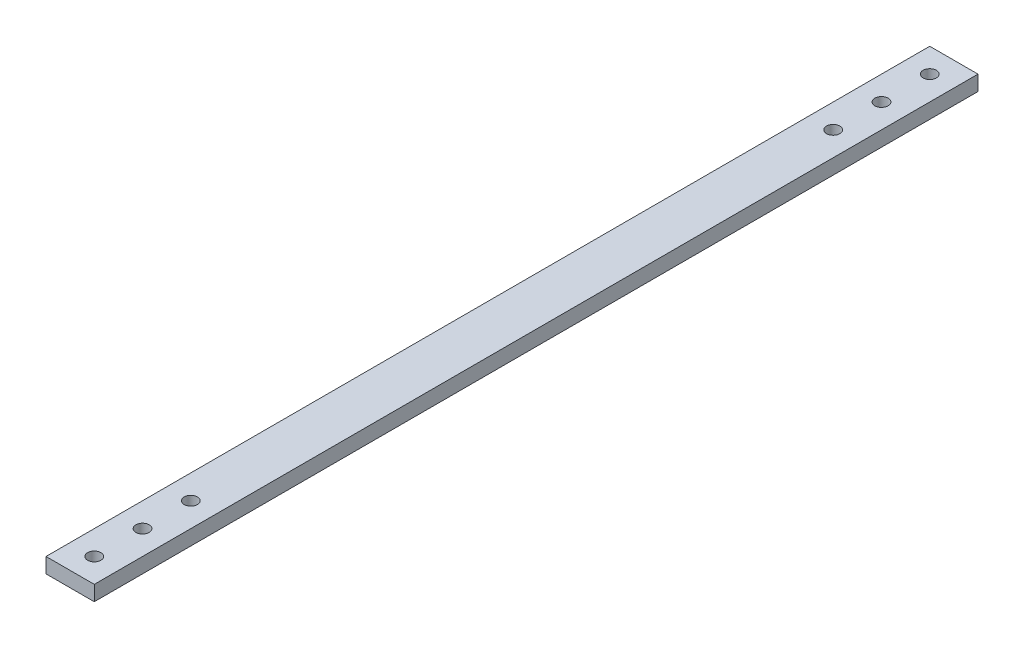
ISO-10303-21;
HEADER;
FILE_DESCRIPTION(('STEP AP214'),'2;1');
FILE_NAME('part.step','',(''),(''),'','','');
FILE_SCHEMA(('AUTOMOTIVE_DESIGN { 1 0 10303 214 1 1 1 1 }'));
ENDSEC;
DATA;
#1=APPLICATION_CONTEXT('core data for automotive mechanical design processes');
#2=APPLICATION_PROTOCOL_DEFINITION('international standard','automotive_design',2000,#1);
#3=PRODUCT_CONTEXT('',#1,'mechanical');
#4=PRODUCT('Part','Part','',(#3));
#5=PRODUCT_RELATED_PRODUCT_CATEGORY('part','',(#4));
#6=PRODUCT_DEFINITION_FORMATION('','',#4);
#7=PRODUCT_DEFINITION_CONTEXT('part definition',#1,'design');
#8=PRODUCT_DEFINITION('design','',#6,#7);
#9=PRODUCT_DEFINITION_SHAPE('','',#8);
#10=(LENGTH_UNIT() NAMED_UNIT(*) SI_UNIT(.MILLI.,.METRE.));
#11=(NAMED_UNIT(*) PLANE_ANGLE_UNIT() SI_UNIT($,.RADIAN.));
#12=(NAMED_UNIT(*) SI_UNIT($,.STERADIAN.) SOLID_ANGLE_UNIT());
#13=UNCERTAINTY_MEASURE_WITH_UNIT(LENGTH_MEASURE(1.E-05),#10,'distance_accuracy_value','');
#14=(GEOMETRIC_REPRESENTATION_CONTEXT(3) GLOBAL_UNCERTAINTY_ASSIGNED_CONTEXT((#13)) GLOBAL_UNIT_ASSIGNED_CONTEXT((#10,
#11,#12)) REPRESENTATION_CONTEXT('',''));
#15=CARTESIAN_POINT('',(0.,0.,0.));
#16=DIRECTION('',(0.,0.,1.));
#17=DIRECTION('',(1.,0.,0.));
#18=AXIS2_PLACEMENT_3D('',#15,#16,#17);
#19=CARTESIAN_POINT('',(-12.7,3.96875,232.5));
#20=DIRECTION('',(1.,0.,0.));
#21=DIRECTION('',(0.,0.,-1.));
#22=AXIS2_PLACEMENT_3D('',#19,#20,#21);
#23=PLANE('',#22);
#24=DIRECTION('',(0.,-1.,0.));
#25=VECTOR('',#24,1.);
#26=CARTESIAN_POINT('',(-12.7,3.96875,-232.5));
#27=LINE('',#26,#25);
#28=CARTESIAN_POINT('',(-12.7,3.96875,-232.5));
#29=VERTEX_POINT('',#28);
#30=CARTESIAN_POINT('',(-12.7,-3.96875,-232.5));
#31=VERTEX_POINT('',#30);
#32=EDGE_CURVE('E100',#29,#31,#27,.T.);
#33=ORIENTED_EDGE('',*,*,#32,.T.);
#34=DIRECTION('',(0.,0.,-1.));
#35=VECTOR('',#34,1.);
#36=CARTESIAN_POINT('',(-12.7,-3.96875,232.5));
#37=LINE('',#36,#35);
#38=CARTESIAN_POINT('',(-12.7,-3.96875,232.5));
#39=VERTEX_POINT('',#38);
#40=EDGE_CURVE('E11',#39,#31,#37,.T.);
#41=ORIENTED_EDGE('',*,*,#40,.F.);
#42=DIRECTION('',(0.,-1.,0.));
#43=VECTOR('',#42,1.);
#44=CARTESIAN_POINT('',(-12.7,3.96875,232.5));
#45=LINE('',#44,#43);
#46=CARTESIAN_POINT('',(-12.7,3.96875,232.5));
#47=VERTEX_POINT('',#46);
#48=EDGE_CURVE('E88',#47,#39,#45,.T.);
#49=ORIENTED_EDGE('',*,*,#48,.F.);
#50=DIRECTION('',(0.,0.,-1.));
#51=VECTOR('',#50,1.);
#52=CARTESIAN_POINT('',(-12.7,3.96875,232.5));
#53=LINE('',#52,#51);
#54=EDGE_CURVE('E96',#47,#29,#53,.T.);
#55=ORIENTED_EDGE('',*,*,#54,.T.);
#56=EDGE_LOOP('',(#33,#41,#49,#55));
#57=FACE_BOUND('',#56,.T.);
#58=ADVANCED_FACE('F37',(#57),#23,.F.);
#59=CARTESIAN_POINT('',(12.7,-3.96875,232.5));
#60=DIRECTION('',(0.,1.,0.));
#61=DIRECTION('',(0.,0.,1.));
#62=AXIS2_PLACEMENT_3D('',#59,#60,#61);
#63=PLANE('',#62);
#64=CARTESIAN_POINT('',(0.,-3.96875,-219.8));
#65=DIRECTION('',(0.,1.,0.));
#66=DIRECTION('',(0.,0.,1.));
#67=AXIS2_PLACEMENT_3D('',#64,#65,#66);
#68=CIRCLE('',#67,3.5);
#69=CARTESIAN_POINT('',(0.,-3.96875,-216.3));
#70=VERTEX_POINT('',#69);
#71=EDGE_CURVE('E103',#70,#70,#68,.T.);
#72=ORIENTED_EDGE('',*,*,#71,.T.);
#73=EDGE_LOOP('',(#72));
#74=FACE_BOUND('',#73,.T.);
#75=CARTESIAN_POINT('',(0.,-3.96875,-194.4));
#76=DIRECTION('',(0.,1.,0.));
#77=DIRECTION('',(0.,0.,1.));
#78=AXIS2_PLACEMENT_3D('',#75,#76,#77);
#79=CIRCLE('',#78,3.5);
#80=CARTESIAN_POINT('',(0.,-3.96875,-190.9));
#81=VERTEX_POINT('',#80);
#82=EDGE_CURVE('E141',#81,#81,#79,.T.);
#83=ORIENTED_EDGE('',*,*,#82,.T.);
#84=EDGE_LOOP('',(#83));
#85=FACE_BOUND('',#84,.T.);
#86=CARTESIAN_POINT('',(0.,-3.96875,-169.));
#87=DIRECTION('',(0.,1.,0.));
#88=DIRECTION('',(0.,0.,1.));
#89=AXIS2_PLACEMENT_3D('',#86,#87,#88);
#90=CIRCLE('',#89,3.5);
#91=CARTESIAN_POINT('',(0.,-3.96875,-165.5));
#92=VERTEX_POINT('',#91);
#93=EDGE_CURVE('E135',#92,#92,#90,.T.);
#94=ORIENTED_EDGE('',*,*,#93,.T.);
#95=EDGE_LOOP('',(#94));
#96=FACE_BOUND('',#95,.T.);
#97=CARTESIAN_POINT('',(0.,-3.96875,169.));
#98=DIRECTION('',(0.,1.,0.));
#99=DIRECTION('',(0.,0.,-1.));
#100=AXIS2_PLACEMENT_3D('',#97,#98,#99);
#101=CIRCLE('',#100,3.5);
#102=CARTESIAN_POINT('',(0.,-3.96875,165.5));
#103=VERTEX_POINT('',#102);
#104=EDGE_CURVE('E129',#103,#103,#101,.T.);
#105=ORIENTED_EDGE('',*,*,#104,.T.);
#106=EDGE_LOOP('',(#105));
#107=FACE_BOUND('',#106,.T.);
#108=CARTESIAN_POINT('',(0.,-3.96875,194.4));
#109=DIRECTION('',(0.,1.,0.));
#110=DIRECTION('',(0.,0.,-1.));
#111=AXIS2_PLACEMENT_3D('',#108,#109,#110);
#112=CIRCLE('',#111,3.5);
#113=CARTESIAN_POINT('',(0.,-3.96875,190.9));
#114=VERTEX_POINT('',#113);
#115=EDGE_CURVE('E123',#114,#114,#112,.T.);
#116=ORIENTED_EDGE('',*,*,#115,.T.);
#117=EDGE_LOOP('',(#116));
#118=FACE_BOUND('',#117,.T.);
#119=CARTESIAN_POINT('',(0.,-3.96875,219.8));
#120=DIRECTION('',(0.,1.,0.));
#121=DIRECTION('',(0.,0.,-1.));
#122=AXIS2_PLACEMENT_3D('',#119,#120,#121);
#123=CIRCLE('',#122,3.5);
#124=CARTESIAN_POINT('',(0.,-3.96875,216.3));
#125=VERTEX_POINT('',#124);
#126=EDGE_CURVE('E117',#125,#125,#123,.T.);
#127=ORIENTED_EDGE('',*,*,#126,.T.);
#128=EDGE_LOOP('',(#127));
#129=FACE_BOUND('',#128,.T.);
#130=DIRECTION('',(1.,0.,0.));
#131=VECTOR('',#130,1.);
#132=CARTESIAN_POINT('',(12.7,-3.96875,-232.5));
#133=LINE('',#132,#131);
#134=CARTESIAN_POINT('',(12.7,-3.96875,-232.5));
#135=VERTEX_POINT('',#134);
#136=EDGE_CURVE('E92',#31,#135,#133,.T.);
#137=ORIENTED_EDGE('',*,*,#136,.T.);
#138=DIRECTION('',(0.,0.,-1.));
#139=VECTOR('',#138,1.);
#140=CARTESIAN_POINT('',(12.7,-3.96875,232.5));
#141=LINE('',#140,#139);
#142=CARTESIAN_POINT('',(12.7,-3.96875,232.5));
#143=VERTEX_POINT('',#142);
#144=EDGE_CURVE('E45',#143,#135,#141,.T.);
#145=ORIENTED_EDGE('',*,*,#144,.F.);
#146=DIRECTION('',(1.,0.,0.));
#147=VECTOR('',#146,1.);
#148=CARTESIAN_POINT('',(12.7,-3.96875,232.5));
#149=LINE('',#148,#147);
#150=EDGE_CURVE('E83',#39,#143,#149,.T.);
#151=ORIENTED_EDGE('',*,*,#150,.F.);
#152=ORIENTED_EDGE('',*,*,#40,.T.);
#153=EDGE_LOOP('',(#137,#145,#151,#152));
#154=FACE_BOUND('',#153,.T.);
#155=ADVANCED_FACE('F91',(#74,#85,#96,#107,#118,#129,#154),#63,.F.);
#156=CARTESIAN_POINT('',(12.7,3.96875,232.5));
#157=DIRECTION('',(-1.,0.,0.));
#158=DIRECTION('',(0.,0.,1.));
#159=AXIS2_PLACEMENT_3D('',#156,#157,#158);
#160=PLANE('',#159);
#161=DIRECTION('',(0.,1.,0.));
#162=VECTOR('',#161,1.);
#163=CARTESIAN_POINT('',(12.7,3.96875,-232.5));
#164=LINE('',#163,#162);
#165=CARTESIAN_POINT('',(12.7,3.96875,-232.5));
#166=VERTEX_POINT('',#165);
#167=EDGE_CURVE('E70',#135,#166,#164,.T.);
#168=ORIENTED_EDGE('',*,*,#167,.T.);
#169=DIRECTION('',(0.,0.,-1.));
#170=VECTOR('',#169,1.);
#171=CARTESIAN_POINT('',(12.7,3.96875,232.5));
#172=LINE('',#171,#170);
#173=CARTESIAN_POINT('',(12.7,3.96875,232.5));
#174=VERTEX_POINT('',#173);
#175=EDGE_CURVE('E93',#174,#166,#172,.T.);
#176=ORIENTED_EDGE('',*,*,#175,.F.);
#177=DIRECTION('',(0.,1.,0.));
#178=VECTOR('',#177,1.);
#179=CARTESIAN_POINT('',(12.7,3.96875,232.5));
#180=LINE('',#179,#178);
#181=EDGE_CURVE('E86',#143,#174,#180,.T.);
#182=ORIENTED_EDGE('',*,*,#181,.F.);
#183=ORIENTED_EDGE('',*,*,#144,.T.);
#184=EDGE_LOOP('',(#168,#176,#182,#183));
#185=FACE_BOUND('',#184,.T.);
#186=ADVANCED_FACE('F94',(#185),#160,.F.);
#187=CARTESIAN_POINT('',(12.7,3.96875,232.5));
#188=DIRECTION('',(0.,-1.,0.));
#189=DIRECTION('',(0.,0.,-1.));
#190=AXIS2_PLACEMENT_3D('',#187,#188,#189);
#191=PLANE('',#190);
#192=CARTESIAN_POINT('',(0.,3.96875,-219.8));
#193=DIRECTION('',(0.,1.,0.));
#194=DIRECTION('',(0.,0.,1.));
#195=AXIS2_PLACEMENT_3D('',#192,#193,#194);
#196=CIRCLE('',#195,3.5);
#197=CARTESIAN_POINT('',(0.,3.96875,-216.3));
#198=VERTEX_POINT('',#197);
#199=EDGE_CURVE('E144',#198,#198,#196,.T.);
#200=ORIENTED_EDGE('',*,*,#199,.F.);
#201=EDGE_LOOP('',(#200));
#202=FACE_BOUND('',#201,.T.);
#203=CARTESIAN_POINT('',(0.,3.96875,-194.4));
#204=DIRECTION('',(0.,1.,0.));
#205=DIRECTION('',(0.,0.,1.));
#206=AXIS2_PLACEMENT_3D('',#203,#204,#205);
#207=CIRCLE('',#206,3.5);
#208=CARTESIAN_POINT('',(0.,3.96875,-190.9));
#209=VERTEX_POINT('',#208);
#210=EDGE_CURVE('E138',#209,#209,#207,.T.);
#211=ORIENTED_EDGE('',*,*,#210,.F.);
#212=EDGE_LOOP('',(#211));
#213=FACE_BOUND('',#212,.T.);
#214=CARTESIAN_POINT('',(0.,3.96875,-169.));
#215=DIRECTION('',(0.,1.,0.));
#216=DIRECTION('',(0.,0.,1.));
#217=AXIS2_PLACEMENT_3D('',#214,#215,#216);
#218=CIRCLE('',#217,3.5);
#219=CARTESIAN_POINT('',(0.,3.96875,-165.5));
#220=VERTEX_POINT('',#219);
#221=EDGE_CURVE('E132',#220,#220,#218,.T.);
#222=ORIENTED_EDGE('',*,*,#221,.F.);
#223=EDGE_LOOP('',(#222));
#224=FACE_BOUND('',#223,.T.);
#225=CARTESIAN_POINT('',(0.,3.96875,169.));
#226=DIRECTION('',(0.,1.,0.));
#227=DIRECTION('',(0.,0.,-1.));
#228=AXIS2_PLACEMENT_3D('',#225,#226,#227);
#229=CIRCLE('',#228,3.5);
#230=CARTESIAN_POINT('',(0.,3.96875,165.5));
#231=VERTEX_POINT('',#230);
#232=EDGE_CURVE('E126',#231,#231,#229,.T.);
#233=ORIENTED_EDGE('',*,*,#232,.F.);
#234=EDGE_LOOP('',(#233));
#235=FACE_BOUND('',#234,.T.);
#236=CARTESIAN_POINT('',(0.,3.96875,194.4));
#237=DIRECTION('',(0.,1.,0.));
#238=DIRECTION('',(0.,0.,-1.));
#239=AXIS2_PLACEMENT_3D('',#236,#237,#238);
#240=CIRCLE('',#239,3.5);
#241=CARTESIAN_POINT('',(0.,3.96875,190.9));
#242=VERTEX_POINT('',#241);
#243=EDGE_CURVE('E120',#242,#242,#240,.T.);
#244=ORIENTED_EDGE('',*,*,#243,.F.);
#245=EDGE_LOOP('',(#244));
#246=FACE_BOUND('',#245,.T.);
#247=CARTESIAN_POINT('',(0.,3.96875,219.8));
#248=DIRECTION('',(0.,1.,0.));
#249=DIRECTION('',(0.,0.,-1.));
#250=AXIS2_PLACEMENT_3D('',#247,#248,#249);
#251=CIRCLE('',#250,3.5);
#252=CARTESIAN_POINT('',(0.,3.96875,216.3));
#253=VERTEX_POINT('',#252);
#254=EDGE_CURVE('E114',#253,#253,#251,.T.);
#255=ORIENTED_EDGE('',*,*,#254,.F.);
#256=EDGE_LOOP('',(#255));
#257=FACE_BOUND('',#256,.T.);
#258=DIRECTION('',(-1.,0.,0.));
#259=VECTOR('',#258,1.);
#260=CARTESIAN_POINT('',(12.7,3.96875,-232.5));
#261=LINE('',#260,#259);
#262=EDGE_CURVE('E76',#166,#29,#261,.T.);
#263=ORIENTED_EDGE('',*,*,#262,.T.);
#264=ORIENTED_EDGE('',*,*,#54,.F.);
#265=DIRECTION('',(-1.,0.,0.));
#266=VECTOR('',#265,1.);
#267=CARTESIAN_POINT('',(12.7,3.96875,232.5));
#268=LINE('',#267,#266);
#269=EDGE_CURVE('E53',#174,#47,#268,.T.);
#270=ORIENTED_EDGE('',*,*,#269,.F.);
#271=ORIENTED_EDGE('',*,*,#175,.T.);
#272=EDGE_LOOP('',(#263,#264,#270,#271));
#273=FACE_BOUND('',#272,.T.);
#274=ADVANCED_FACE('F108',(#202,#213,#224,#235,#246,#257,#273),#191,.F.);
#275=CARTESIAN_POINT('',(0.,0.,232.5));
#276=DIRECTION('',(0.,0.,-1.));
#277=DIRECTION('',(-1.,0.,0.));
#278=AXIS2_PLACEMENT_3D('',#275,#276,#277);
#279=PLANE('',#278);
#280=ORIENTED_EDGE('',*,*,#48,.T.);
#281=ORIENTED_EDGE('',*,*,#150,.T.);
#282=ORIENTED_EDGE('',*,*,#181,.T.);
#283=ORIENTED_EDGE('',*,*,#269,.T.);
#284=EDGE_LOOP('',(#280,#281,#282,#283));
#285=FACE_BOUND('',#284,.T.);
#286=ADVANCED_FACE('F84',(#285),#279,.F.);
#287=CARTESIAN_POINT('',(0.,0.,-232.5));
#288=DIRECTION('',(0.,0.,-1.));
#289=DIRECTION('',(-1.,0.,0.));
#290=AXIS2_PLACEMENT_3D('',#287,#288,#289);
#291=PLANE('',#290);
#292=ORIENTED_EDGE('',*,*,#32,.F.);
#293=ORIENTED_EDGE('',*,*,#262,.F.);
#294=ORIENTED_EDGE('',*,*,#167,.F.);
#295=ORIENTED_EDGE('',*,*,#136,.F.);
#296=EDGE_LOOP('',(#292,#293,#294,#295));
#297=FACE_BOUND('',#296,.T.);
#298=ADVANCED_FACE('F111',(#297),#291,.T.);
#299=CARTESIAN_POINT('',(0.,-3.96875,219.8));
#300=DIRECTION('',(0.,1.,0.));
#301=DIRECTION('',(0.,0.,1.));
#302=AXIS2_PLACEMENT_3D('',#299,#300,#301);
#303=CYLINDRICAL_SURFACE('',#302,3.5);
#304=ORIENTED_EDGE('',*,*,#126,.F.);
#305=EDGE_LOOP('',(#304));
#306=FACE_BOUND('',#305,.T.);
#307=ORIENTED_EDGE('',*,*,#254,.T.);
#308=EDGE_LOOP('',(#307));
#309=FACE_BOUND('',#308,.T.);
#310=ADVANCED_FACE('F172',(#306,#309),#303,.F.);
#311=CARTESIAN_POINT('',(0.,-3.96875,194.4));
#312=DIRECTION('',(0.,1.,0.));
#313=DIRECTION('',(0.,0.,1.));
#314=AXIS2_PLACEMENT_3D('',#311,#312,#313);
#315=CYLINDRICAL_SURFACE('',#314,3.5);
#316=ORIENTED_EDGE('',*,*,#115,.F.);
#317=EDGE_LOOP('',(#316));
#318=FACE_BOUND('',#317,.T.);
#319=ORIENTED_EDGE('',*,*,#243,.T.);
#320=EDGE_LOOP('',(#319));
#321=FACE_BOUND('',#320,.T.);
#322=ADVANCED_FACE('F174',(#318,#321),#315,.F.);
#323=CARTESIAN_POINT('',(0.,-3.96875,169.));
#324=DIRECTION('',(0.,1.,0.));
#325=DIRECTION('',(0.,0.,1.));
#326=AXIS2_PLACEMENT_3D('',#323,#324,#325);
#327=CYLINDRICAL_SURFACE('',#326,3.5);
#328=ORIENTED_EDGE('',*,*,#104,.F.);
#329=EDGE_LOOP('',(#328));
#330=FACE_BOUND('',#329,.T.);
#331=ORIENTED_EDGE('',*,*,#232,.T.);
#332=EDGE_LOOP('',(#331));
#333=FACE_BOUND('',#332,.T.);
#334=ADVANCED_FACE('F181',(#330,#333),#327,.F.);
#335=CARTESIAN_POINT('',(0.,-3.96875,-169.));
#336=DIRECTION('',(0.,1.,0.));
#337=DIRECTION('',(0.,0.,1.));
#338=AXIS2_PLACEMENT_3D('',#335,#336,#337);
#339=CYLINDRICAL_SURFACE('',#338,3.5);
#340=ORIENTED_EDGE('',*,*,#93,.F.);
#341=EDGE_LOOP('',(#340));
#342=FACE_BOUND('',#341,.T.);
#343=ORIENTED_EDGE('',*,*,#221,.T.);
#344=EDGE_LOOP('',(#343));
#345=FACE_BOUND('',#344,.T.);
#346=ADVANCED_FACE('F234',(#342,#345),#339,.F.);
#347=CARTESIAN_POINT('',(0.,-3.96875,-194.4));
#348=DIRECTION('',(0.,1.,0.));
#349=DIRECTION('',(0.,0.,1.));
#350=AXIS2_PLACEMENT_3D('',#347,#348,#349);
#351=CYLINDRICAL_SURFACE('',#350,3.5);
#352=ORIENTED_EDGE('',*,*,#82,.F.);
#353=EDGE_LOOP('',(#352));
#354=FACE_BOUND('',#353,.T.);
#355=ORIENTED_EDGE('',*,*,#210,.T.);
#356=EDGE_LOOP('',(#355));
#357=FACE_BOUND('',#356,.T.);
#358=ADVANCED_FACE('F155',(#354,#357),#351,.F.);
#359=CARTESIAN_POINT('',(0.,-3.96875,-219.8));
#360=DIRECTION('',(0.,1.,0.));
#361=DIRECTION('',(0.,0.,1.));
#362=AXIS2_PLACEMENT_3D('',#359,#360,#361);
#363=CYLINDRICAL_SURFACE('',#362,3.5);
#364=ORIENTED_EDGE('',*,*,#71,.F.);
#365=EDGE_LOOP('',(#364));
#366=FACE_BOUND('',#365,.T.);
#367=ORIENTED_EDGE('',*,*,#199,.T.);
#368=EDGE_LOOP('',(#367));
#369=FACE_BOUND('',#368,.T.);
#370=ADVANCED_FACE('F152',(#366,#369),#363,.F.);
#371=CLOSED_SHELL('',(#58,#155,#186,#274,#286,#298,#310,#322,#334,#346,#358,#370));
#372=MANIFOLD_SOLID_BREP('B2',#371);
#373=ADVANCED_BREP_SHAPE_REPRESENTATION('',(#18,#372),#14);
#374=SHAPE_DEFINITION_REPRESENTATION(#9,#373);
ENDSEC;
END-ISO-10303-21;
